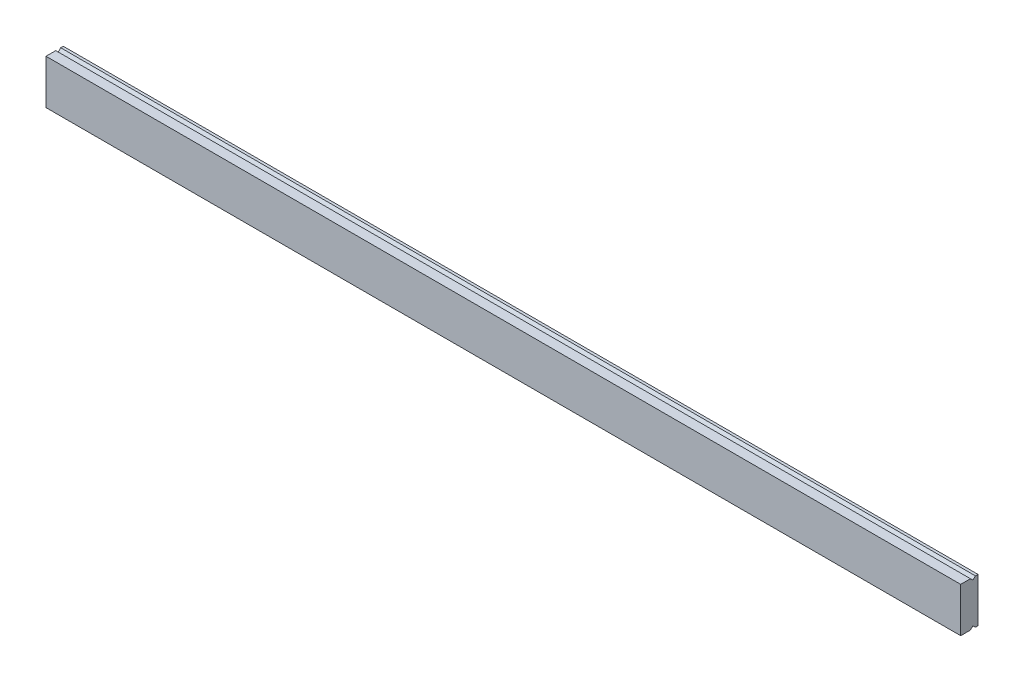
ISO-10303-21;
HEADER;
FILE_DESCRIPTION(('STEP AP214'),'2;1');
FILE_NAME('part.step','',(''),(''),'','','');
FILE_SCHEMA(('AUTOMOTIVE_DESIGN { 1 0 10303 214 1 1 1 1 }'));
ENDSEC;
DATA;
#1=APPLICATION_CONTEXT('core data for automotive mechanical design processes');
#2=APPLICATION_PROTOCOL_DEFINITION('international standard','automotive_design',2000,#1);
#3=PRODUCT_CONTEXT('',#1,'mechanical');
#4=PRODUCT('Part','Part','',(#3));
#5=PRODUCT_RELATED_PRODUCT_CATEGORY('part','',(#4));
#6=PRODUCT_DEFINITION_FORMATION('','',#4);
#7=PRODUCT_DEFINITION_CONTEXT('part definition',#1,'design');
#8=PRODUCT_DEFINITION('design','',#6,#7);
#9=PRODUCT_DEFINITION_SHAPE('','',#8);
#10=(LENGTH_UNIT() NAMED_UNIT(*) SI_UNIT(.MILLI.,.METRE.));
#11=(NAMED_UNIT(*) PLANE_ANGLE_UNIT() SI_UNIT($,.RADIAN.));
#12=(NAMED_UNIT(*) SI_UNIT($,.STERADIAN.) SOLID_ANGLE_UNIT());
#13=UNCERTAINTY_MEASURE_WITH_UNIT(LENGTH_MEASURE(1.E-05),#10,'distance_accuracy_value','');
#14=(GEOMETRIC_REPRESENTATION_CONTEXT(3) GLOBAL_UNCERTAINTY_ASSIGNED_CONTEXT((#13)) GLOBAL_UNIT_ASSIGNED_CONTEXT((#10,
#11,#12)) REPRESENTATION_CONTEXT('',''));
#15=CARTESIAN_POINT('',(0.,0.,0.));
#16=DIRECTION('',(0.,0.,1.));
#17=DIRECTION('',(1.,0.,0.));
#18=AXIS2_PLACEMENT_3D('',#15,#16,#17);
#19=CARTESIAN_POINT('',(465.,249.,464.05));
#20=DIRECTION('',(0.,1.,0.));
#21=DIRECTION('',(0.,0.,1.));
#22=AXIS2_PLACEMENT_3D('',#19,#20,#21);
#23=PLANE('',#22);
#24=DIRECTION('',(0.,0.,-1.));
#25=VECTOR('',#24,1.);
#26=CARTESIAN_POINT('',(95.,249.,464.05));
#27=LINE('',#26,#25);
#28=CARTESIAN_POINT('',(95.,249.,464.05));
#29=VERTEX_POINT('',#28);
#30=CARTESIAN_POINT('',(95.,249.,463.));
#31=VERTEX_POINT('',#30);
#32=EDGE_CURVE('E154',#29,#31,#27,.T.);
#33=ORIENTED_EDGE('',*,*,#32,.F.);
#34=DIRECTION('',(-1.,0.,0.));
#35=VECTOR('',#34,1.);
#36=CARTESIAN_POINT('',(465.,249.,464.05));
#37=LINE('',#36,#35);
#38=CARTESIAN_POINT('',(465.,249.,464.05));
#39=VERTEX_POINT('',#38);
#40=EDGE_CURVE('E11',#39,#29,#37,.T.);
#41=ORIENTED_EDGE('',*,*,#40,.F.);
#42=DIRECTION('',(0.,0.,-1.));
#43=VECTOR('',#42,1.);
#44=CARTESIAN_POINT('',(465.,249.,464.05));
#45=LINE('',#44,#43);
#46=CARTESIAN_POINT('',(465.,249.,463.));
#47=VERTEX_POINT('',#46);
#48=EDGE_CURVE('E190',#39,#47,#45,.T.);
#49=ORIENTED_EDGE('',*,*,#48,.T.);
#50=DIRECTION('',(-1.,0.,0.));
#51=VECTOR('',#50,1.);
#52=CARTESIAN_POINT('',(465.,249.,463.));
#53=LINE('',#52,#51);
#54=EDGE_CURVE('E42',#47,#31,#53,.T.);
#55=ORIENTED_EDGE('',*,*,#54,.T.);
#56=EDGE_LOOP('',(#33,#41,#49,#55));
#57=FACE_BOUND('',#56,.T.);
#58=ADVANCED_FACE('F39',(#57),#23,.T.);
#59=CARTESIAN_POINT('',(465.,248.,465.05));
#60=DIRECTION('',(0.,0.707106781186547,0.707106781186547));
#61=DIRECTION('',(0.,-0.707106781186548,0.707106781186548));
#62=AXIS2_PLACEMENT_3D('',#59,#60,#61);
#63=PLANE('',#62);
#64=DIRECTION('',(0.,0.707106781186547,-0.707106781186547));
#65=VECTOR('',#64,1.);
#66=CARTESIAN_POINT('',(95.,248.,465.05));
#67=LINE('',#66,#65);
#68=CARTESIAN_POINT('',(95.,248.,465.05));
#69=VERTEX_POINT('',#68);
#70=EDGE_CURVE('E187',#69,#29,#67,.T.);
#71=ORIENTED_EDGE('',*,*,#70,.F.);
#72=DIRECTION('',(-1.,0.,0.));
#73=VECTOR('',#72,1.);
#74=CARTESIAN_POINT('',(465.,248.,465.05));
#75=LINE('',#74,#73);
#76=CARTESIAN_POINT('',(465.,248.,465.05));
#77=VERTEX_POINT('',#76);
#78=EDGE_CURVE('E49',#77,#69,#75,.T.);
#79=ORIENTED_EDGE('',*,*,#78,.F.);
#80=DIRECTION('',(0.,0.707106781186547,-0.707106781186547));
#81=VECTOR('',#80,1.);
#82=CARTESIAN_POINT('',(465.,248.,465.05));
#83=LINE('',#82,#81);
#84=EDGE_CURVE('E140',#77,#39,#83,.T.);
#85=ORIENTED_EDGE('',*,*,#84,.T.);
#86=ORIENTED_EDGE('',*,*,#40,.T.);
#87=EDGE_LOOP('',(#71,#79,#85,#86));
#88=FACE_BOUND('',#87,.T.);
#89=ADVANCED_FACE('F214',(#88),#63,.T.);
#90=CARTESIAN_POINT('',(465.,249.,466.05));
#91=DIRECTION('',(0.,0.707106781186547,-0.707106781186547));
#92=DIRECTION('',(0.,0.707106781186548,0.707106781186548));
#93=AXIS2_PLACEMENT_3D('',#90,#91,#92);
#94=PLANE('',#93);
#95=DIRECTION('',(0.,-0.707106781186547,-0.707106781186547));
#96=VECTOR('',#95,1.);
#97=CARTESIAN_POINT('',(95.,249.,466.05));
#98=LINE('',#97,#96);
#99=CARTESIAN_POINT('',(95.,249.,466.05));
#100=VERTEX_POINT('',#99);
#101=EDGE_CURVE('E126',#100,#69,#98,.T.);
#102=ORIENTED_EDGE('',*,*,#101,.F.);
#103=DIRECTION('',(-1.,0.,0.));
#104=VECTOR('',#103,1.);
#105=CARTESIAN_POINT('',(465.,249.,466.05));
#106=LINE('',#105,#104);
#107=CARTESIAN_POINT('',(465.,249.,466.05));
#108=VERTEX_POINT('',#107);
#109=EDGE_CURVE('E121',#108,#100,#106,.T.);
#110=ORIENTED_EDGE('',*,*,#109,.F.);
#111=DIRECTION('',(0.,-0.707106781186547,-0.707106781186547));
#112=VECTOR('',#111,1.);
#113=CARTESIAN_POINT('',(465.,249.,466.05));
#114=LINE('',#113,#112);
#115=EDGE_CURVE('E124',#108,#77,#114,.T.);
#116=ORIENTED_EDGE('',*,*,#115,.T.);
#117=ORIENTED_EDGE('',*,*,#78,.T.);
#118=EDGE_LOOP('',(#102,#110,#116,#117));
#119=FACE_BOUND('',#118,.T.);
#120=ADVANCED_FACE('F123',(#119),#94,.T.);
#121=CARTESIAN_POINT('',(465.,249.,470.));
#122=DIRECTION('',(0.,1.,0.));
#123=DIRECTION('',(0.,0.,1.));
#124=AXIS2_PLACEMENT_3D('',#121,#122,#123);
#125=PLANE('',#124);
#126=DIRECTION('',(0.,0.,-1.));
#127=VECTOR('',#126,1.);
#128=CARTESIAN_POINT('',(95.,249.,470.));
#129=LINE('',#128,#127);
#130=CARTESIAN_POINT('',(95.,249.,470.));
#131=VERTEX_POINT('',#130);
#132=EDGE_CURVE('E182',#131,#100,#129,.T.);
#133=ORIENTED_EDGE('',*,*,#132,.F.);
#134=DIRECTION('',(-1.,0.,0.));
#135=VECTOR('',#134,1.);
#136=CARTESIAN_POINT('',(465.,249.,470.));
#137=LINE('',#136,#135);
#138=CARTESIAN_POINT('',(465.,249.,470.));
#139=VERTEX_POINT('',#138);
#140=EDGE_CURVE('E132',#139,#131,#137,.T.);
#141=ORIENTED_EDGE('',*,*,#140,.F.);
#142=DIRECTION('',(0.,0.,-1.));
#143=VECTOR('',#142,1.);
#144=CARTESIAN_POINT('',(465.,249.,470.));
#145=LINE('',#144,#143);
#146=EDGE_CURVE('E138',#139,#108,#145,.T.);
#147=ORIENTED_EDGE('',*,*,#146,.T.);
#148=ORIENTED_EDGE('',*,*,#109,.T.);
#149=EDGE_LOOP('',(#133,#141,#147,#148));
#150=FACE_BOUND('',#149,.T.);
#151=ADVANCED_FACE('F143',(#150),#125,.T.);
#152=CARTESIAN_POINT('',(465.,231.,470.));
#153=DIRECTION('',(0.,0.,1.));
#154=DIRECTION('',(1.,0.,0.));
#155=AXIS2_PLACEMENT_3D('',#152,#153,#154);
#156=PLANE('',#155);
#157=DIRECTION('',(0.,1.,0.));
#158=VECTOR('',#157,1.);
#159=CARTESIAN_POINT('',(95.,231.,470.));
#160=LINE('',#159,#158);
#161=CARTESIAN_POINT('',(95.,231.,470.));
#162=VERTEX_POINT('',#161);
#163=EDGE_CURVE('E178',#162,#131,#160,.T.);
#164=ORIENTED_EDGE('',*,*,#163,.F.);
#165=DIRECTION('',(-1.,0.,0.));
#166=VECTOR('',#165,1.);
#167=CARTESIAN_POINT('',(465.,231.,470.));
#168=LINE('',#167,#166);
#169=CARTESIAN_POINT('',(465.,231.,470.));
#170=VERTEX_POINT('',#169);
#171=EDGE_CURVE('E196',#170,#162,#168,.T.);
#172=ORIENTED_EDGE('',*,*,#171,.F.);
#173=DIRECTION('',(0.,1.,0.));
#174=VECTOR('',#173,1.);
#175=CARTESIAN_POINT('',(465.,231.,470.));
#176=LINE('',#175,#174);
#177=EDGE_CURVE('E145',#170,#139,#176,.T.);
#178=ORIENTED_EDGE('',*,*,#177,.T.);
#179=ORIENTED_EDGE('',*,*,#140,.T.);
#180=EDGE_LOOP('',(#164,#172,#178,#179));
#181=FACE_BOUND('',#180,.T.);
#182=ADVANCED_FACE('F227',(#181),#156,.T.);
#183=CARTESIAN_POINT('',(465.,231.,466.05));
#184=DIRECTION('',(0.,-1.,0.));
#185=DIRECTION('',(0.,0.,-1.));
#186=AXIS2_PLACEMENT_3D('',#183,#184,#185);
#187=PLANE('',#186);
#188=DIRECTION('',(0.,0.,1.));
#189=VECTOR('',#188,1.);
#190=CARTESIAN_POINT('',(95.,231.,466.05));
#191=LINE('',#190,#189);
#192=CARTESIAN_POINT('',(95.,231.,466.05));
#193=VERTEX_POINT('',#192);
#194=EDGE_CURVE('E174',#193,#162,#191,.T.);
#195=ORIENTED_EDGE('',*,*,#194,.F.);
#196=DIRECTION('',(-1.,0.,0.));
#197=VECTOR('',#196,1.);
#198=CARTESIAN_POINT('',(465.,231.,466.05));
#199=LINE('',#198,#197);
#200=CARTESIAN_POINT('',(465.,231.,466.05));
#201=VERTEX_POINT('',#200);
#202=EDGE_CURVE('E199',#201,#193,#199,.T.);
#203=ORIENTED_EDGE('',*,*,#202,.F.);
#204=DIRECTION('',(0.,0.,1.));
#205=VECTOR('',#204,1.);
#206=CARTESIAN_POINT('',(465.,231.,466.05));
#207=LINE('',#206,#205);
#208=EDGE_CURVE('E148',#201,#170,#207,.T.);
#209=ORIENTED_EDGE('',*,*,#208,.T.);
#210=ORIENTED_EDGE('',*,*,#171,.T.);
#211=EDGE_LOOP('',(#195,#203,#209,#210));
#212=FACE_BOUND('',#211,.T.);
#213=ADVANCED_FACE('F230',(#212),#187,.T.);
#214=CARTESIAN_POINT('',(465.,232.,465.05));
#215=DIRECTION('',(0.,-0.707106781186547,-0.707106781186547));
#216=DIRECTION('',(0.,0.707106781186548,-0.707106781186548));
#217=AXIS2_PLACEMENT_3D('',#214,#215,#216);
#218=PLANE('',#217);
#219=DIRECTION('',(0.,-0.707106781186547,0.707106781186547));
#220=VECTOR('',#219,1.);
#221=CARTESIAN_POINT('',(95.,232.,465.05));
#222=LINE('',#221,#220);
#223=CARTESIAN_POINT('',(95.,232.,465.05));
#224=VERTEX_POINT('',#223);
#225=EDGE_CURVE('E170',#224,#193,#222,.T.);
#226=ORIENTED_EDGE('',*,*,#225,.F.);
#227=DIRECTION('',(-1.,0.,0.));
#228=VECTOR('',#227,1.);
#229=CARTESIAN_POINT('',(465.,232.,465.05));
#230=LINE('',#229,#228);
#231=CARTESIAN_POINT('',(465.,232.,465.05));
#232=VERTEX_POINT('',#231);
#233=EDGE_CURVE('E202',#232,#224,#230,.T.);
#234=ORIENTED_EDGE('',*,*,#233,.F.);
#235=DIRECTION('',(0.,-0.707106781186547,0.707106781186547));
#236=VECTOR('',#235,1.);
#237=CARTESIAN_POINT('',(465.,232.,465.05));
#238=LINE('',#237,#236);
#239=EDGE_CURVE('E329',#232,#201,#238,.T.);
#240=ORIENTED_EDGE('',*,*,#239,.T.);
#241=ORIENTED_EDGE('',*,*,#202,.T.);
#242=EDGE_LOOP('',(#226,#234,#240,#241));
#243=FACE_BOUND('',#242,.T.);
#244=ADVANCED_FACE('F234',(#243),#218,.T.);
#245=CARTESIAN_POINT('',(465.,231.,464.05));
#246=DIRECTION('',(0.,-0.707106781186547,0.707106781186547));
#247=DIRECTION('',(0.,-0.707106781186548,-0.707106781186548));
#248=AXIS2_PLACEMENT_3D('',#245,#246,#247);
#249=PLANE('',#248);
#250=DIRECTION('',(0.,0.707106781186547,0.707106781186547));
#251=VECTOR('',#250,1.);
#252=CARTESIAN_POINT('',(95.,231.,464.05));
#253=LINE('',#252,#251);
#254=CARTESIAN_POINT('',(95.,231.,464.05));
#255=VERTEX_POINT('',#254);
#256=EDGE_CURVE('E166',#255,#224,#253,.T.);
#257=ORIENTED_EDGE('',*,*,#256,.F.);
#258=DIRECTION('',(-1.,0.,0.));
#259=VECTOR('',#258,1.);
#260=CARTESIAN_POINT('',(465.,231.,464.05));
#261=LINE('',#260,#259);
#262=CARTESIAN_POINT('',(465.,231.,464.05));
#263=VERTEX_POINT('',#262);
#264=EDGE_CURVE('E205',#263,#255,#261,.T.);
#265=ORIENTED_EDGE('',*,*,#264,.F.);
#266=DIRECTION('',(0.,0.707106781186547,0.707106781186547));
#267=VECTOR('',#266,1.);
#268=CARTESIAN_POINT('',(465.,231.,464.05));
#269=LINE('',#268,#267);
#270=EDGE_CURVE('E325',#263,#232,#269,.T.);
#271=ORIENTED_EDGE('',*,*,#270,.T.);
#272=ORIENTED_EDGE('',*,*,#233,.T.);
#273=EDGE_LOOP('',(#257,#265,#271,#272));
#274=FACE_BOUND('',#273,.T.);
#275=ADVANCED_FACE('F238',(#274),#249,.T.);
#276=CARTESIAN_POINT('',(465.,231.,463.));
#277=DIRECTION('',(0.,-1.,0.));
#278=DIRECTION('',(0.,0.,-1.));
#279=AXIS2_PLACEMENT_3D('',#276,#277,#278);
#280=PLANE('',#279);
#281=DIRECTION('',(0.,0.,1.));
#282=VECTOR('',#281,1.);
#283=CARTESIAN_POINT('',(95.,231.,463.));
#284=LINE('',#283,#282);
#285=CARTESIAN_POINT('',(95.,231.,463.));
#286=VERTEX_POINT('',#285);
#287=EDGE_CURVE('E162',#286,#255,#284,.T.);
#288=ORIENTED_EDGE('',*,*,#287,.F.);
#289=DIRECTION('',(-1.,0.,0.));
#290=VECTOR('',#289,1.);
#291=CARTESIAN_POINT('',(465.,231.,463.));
#292=LINE('',#291,#290);
#293=CARTESIAN_POINT('',(465.,231.,463.));
#294=VERTEX_POINT('',#293);
#295=EDGE_CURVE('E207',#294,#286,#292,.T.);
#296=ORIENTED_EDGE('',*,*,#295,.F.);
#297=DIRECTION('',(0.,0.,1.));
#298=VECTOR('',#297,1.);
#299=CARTESIAN_POINT('',(465.,231.,463.));
#300=LINE('',#299,#298);
#301=EDGE_CURVE('E339',#294,#263,#300,.T.);
#302=ORIENTED_EDGE('',*,*,#301,.T.);
#303=ORIENTED_EDGE('',*,*,#264,.T.);
#304=EDGE_LOOP('',(#288,#296,#302,#303));
#305=FACE_BOUND('',#304,.T.);
#306=ADVANCED_FACE('F242',(#305),#280,.T.);
#307=CARTESIAN_POINT('',(465.,249.,463.));
#308=DIRECTION('',(0.,0.,-1.));
#309=DIRECTION('',(-1.,0.,0.));
#310=AXIS2_PLACEMENT_3D('',#307,#308,#309);
#311=PLANE('',#310);
#312=DIRECTION('',(0.,-1.,0.));
#313=VECTOR('',#312,1.);
#314=CARTESIAN_POINT('',(95.,249.,463.));
#315=LINE('',#314,#313);
#316=EDGE_CURVE('E158',#31,#286,#315,.T.);
#317=ORIENTED_EDGE('',*,*,#316,.F.);
#318=ORIENTED_EDGE('',*,*,#54,.F.);
#319=DIRECTION('',(0.,-1.,0.));
#320=VECTOR('',#319,1.);
#321=CARTESIAN_POINT('',(465.,249.,463.));
#322=LINE('',#321,#320);
#323=EDGE_CURVE('E342',#47,#294,#322,.T.);
#324=ORIENTED_EDGE('',*,*,#323,.T.);
#325=ORIENTED_EDGE('',*,*,#295,.T.);
#326=EDGE_LOOP('',(#317,#318,#324,#325));
#327=FACE_BOUND('',#326,.T.);
#328=ADVANCED_FACE('F211',(#327),#311,.T.);
#329=CARTESIAN_POINT('',(465.,0.,0.));
#330=DIRECTION('',(-1.,0.,0.));
#331=DIRECTION('',(0.,0.,1.));
#332=AXIS2_PLACEMENT_3D('',#329,#330,#331);
#333=PLANE('',#332);
#334=ORIENTED_EDGE('',*,*,#48,.F.);
#335=ORIENTED_EDGE('',*,*,#84,.F.);
#336=ORIENTED_EDGE('',*,*,#115,.F.);
#337=ORIENTED_EDGE('',*,*,#146,.F.);
#338=ORIENTED_EDGE('',*,*,#177,.F.);
#339=ORIENTED_EDGE('',*,*,#208,.F.);
#340=ORIENTED_EDGE('',*,*,#239,.F.);
#341=ORIENTED_EDGE('',*,*,#270,.F.);
#342=ORIENTED_EDGE('',*,*,#301,.F.);
#343=ORIENTED_EDGE('',*,*,#323,.F.);
#344=EDGE_LOOP('',(#334,#335,#336,#337,#338,#339,#340,#341,#342,#343));
#345=FACE_BOUND('',#344,.T.);
#346=ADVANCED_FACE('F136',(#345),#333,.F.);
#347=CARTESIAN_POINT('',(95.,0.,0.));
#348=DIRECTION('',(-1.,0.,0.));
#349=DIRECTION('',(0.,0.,1.));
#350=AXIS2_PLACEMENT_3D('',#347,#348,#349);
#351=PLANE('',#350);
#352=ORIENTED_EDGE('',*,*,#32,.T.);
#353=ORIENTED_EDGE('',*,*,#316,.T.);
#354=ORIENTED_EDGE('',*,*,#287,.T.);
#355=ORIENTED_EDGE('',*,*,#256,.T.);
#356=ORIENTED_EDGE('',*,*,#225,.T.);
#357=ORIENTED_EDGE('',*,*,#194,.T.);
#358=ORIENTED_EDGE('',*,*,#163,.T.);
#359=ORIENTED_EDGE('',*,*,#132,.T.);
#360=ORIENTED_EDGE('',*,*,#101,.T.);
#361=ORIENTED_EDGE('',*,*,#70,.T.);
#362=EDGE_LOOP('',(#352,#353,#354,#355,#356,#357,#358,#359,#360,#361));
#363=FACE_BOUND('',#362,.T.);
#364=ADVANCED_FACE('F213',(#363),#351,.T.);
#365=CLOSED_SHELL('',(#58,#89,#120,#151,#182,#213,#244,#275,#306,#328,#346,#364));
#366=MANIFOLD_SOLID_BREP('B2',#365);
#367=ADVANCED_BREP_SHAPE_REPRESENTATION('',(#18,#366),#14);
#368=SHAPE_DEFINITION_REPRESENTATION(#9,#367);
ENDSEC;
END-ISO-10303-21;
